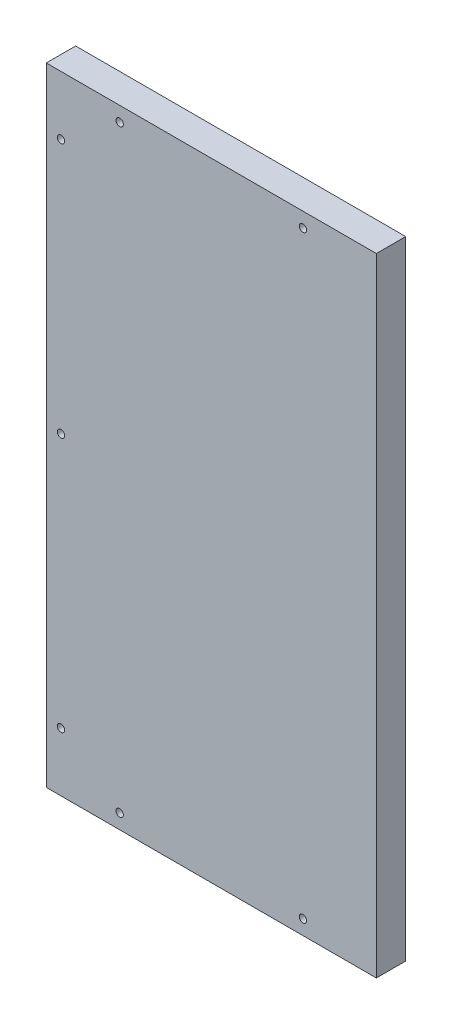
ISO-10303-21;
HEADER;
FILE_DESCRIPTION(('STEP AP214'),'2;1');
FILE_NAME('part.step','',(''),(''),'','','');
FILE_SCHEMA(('AUTOMOTIVE_DESIGN { 1 0 10303 214 1 1 1 1 }'));
ENDSEC;
DATA;
#1=APPLICATION_CONTEXT('core data for automotive mechanical design processes');
#2=APPLICATION_PROTOCOL_DEFINITION('international standard','automotive_design',2000,#1);
#3=PRODUCT_CONTEXT('',#1,'mechanical');
#4=PRODUCT('Part','Part','',(#3));
#5=PRODUCT_RELATED_PRODUCT_CATEGORY('part','',(#4));
#6=PRODUCT_DEFINITION_FORMATION('','',#4);
#7=PRODUCT_DEFINITION_CONTEXT('part definition',#1,'design');
#8=PRODUCT_DEFINITION('design','',#6,#7);
#9=PRODUCT_DEFINITION_SHAPE('','',#8);
#10=(LENGTH_UNIT() NAMED_UNIT(*) SI_UNIT(.MILLI.,.METRE.));
#11=(NAMED_UNIT(*) PLANE_ANGLE_UNIT() SI_UNIT($,.RADIAN.));
#12=(NAMED_UNIT(*) SI_UNIT($,.STERADIAN.) SOLID_ANGLE_UNIT());
#13=UNCERTAINTY_MEASURE_WITH_UNIT(LENGTH_MEASURE(1.E-05),#10,'distance_accuracy_value','');
#14=(GEOMETRIC_REPRESENTATION_CONTEXT(3) GLOBAL_UNCERTAINTY_ASSIGNED_CONTEXT((#13)) GLOBAL_UNIT_ASSIGNED_CONTEXT((#10,
#11,#12)) REPRESENTATION_CONTEXT('',''));
#15=CARTESIAN_POINT('',(0.,0.,0.));
#16=DIRECTION('',(0.,0.,1.));
#17=DIRECTION('',(1.,0.,0.));
#18=AXIS2_PLACEMENT_3D('',#15,#16,#17);
#19=CARTESIAN_POINT('',(-234.75296718065,82.8417413816963,12.6999999999999));
#20=DIRECTION('',(1.,0.,0.));
#21=DIRECTION('',(0.,1.,0.));
#22=AXIS2_PLACEMENT_3D('',#19,#20,#21);
#23=PLANE('',#22);
#24=DIRECTION('',(0.,-1.,0.));
#25=VECTOR('',#24,1.);
#26=CARTESIAN_POINT('',(-234.75296718065,82.8417413816962,0.));
#27=LINE('',#26,#25);
#28=CARTESIAN_POINT('',(-234.75296718065,82.8417413816962,0.));
#29=VERTEX_POINT('',#28);
#30=CARTESIAN_POINT('',(-234.75296718065,-188.523788764369,6.66133814775094E-13));
#31=VERTEX_POINT('',#30);
#32=EDGE_CURVE('E107',#29,#31,#27,.T.);
#33=ORIENTED_EDGE('',*,*,#32,.T.);
#34=DIRECTION('',(0.,0.,-1.));
#35=VECTOR('',#34,1.);
#36=CARTESIAN_POINT('',(-234.75296718065,-188.523788764369,12.7000000000006));
#37=LINE('',#36,#35);
#38=CARTESIAN_POINT('',(-234.75296718065,-188.523788764369,12.7000000000006));
#39=VERTEX_POINT('',#38);
#40=EDGE_CURVE('E11',#39,#31,#37,.T.);
#41=ORIENTED_EDGE('',*,*,#40,.F.);
#42=DIRECTION('',(0.,-1.,0.));
#43=VECTOR('',#42,1.);
#44=CARTESIAN_POINT('',(-234.75296718065,82.8417413816963,12.6999999999999));
#45=LINE('',#44,#43);
#46=CARTESIAN_POINT('',(-234.75296718065,82.8417413816963,12.6999999999999));
#47=VERTEX_POINT('',#46);
#48=EDGE_CURVE('E94',#47,#39,#45,.T.);
#49=ORIENTED_EDGE('',*,*,#48,.F.);
#50=DIRECTION('',(0.,0.,-1.));
#51=VECTOR('',#50,1.);
#52=CARTESIAN_POINT('',(-234.75296718065,82.8417413816963,12.6999999999999));
#53=LINE('',#52,#51);
#54=EDGE_CURVE('E103',#47,#29,#53,.T.);
#55=ORIENTED_EDGE('',*,*,#54,.T.);
#56=EDGE_LOOP('',(#33,#41,#49,#55));
#57=FACE_BOUND('',#56,.T.);
#58=ADVANCED_FACE('F41',(#57),#23,.F.);
#59=CARTESIAN_POINT('',(-234.75296718065,-188.523788764369,12.7000000000006));
#60=DIRECTION('',(0.,1.,0.));
#61=DIRECTION('',(0.,0.,1.));
#62=AXIS2_PLACEMENT_3D('',#59,#60,#61);
#63=PLANE('',#62);
#64=DIRECTION('',(1.,0.,0.));
#65=VECTOR('',#64,1.);
#66=CARTESIAN_POINT('',(-234.75296718065,-188.523788764369,6.66133814775094E-13));
#67=LINE('',#66,#65);
#68=CARTESIAN_POINT('',(-91.9973273926184,-188.523788764369,1.33226762955019E-12));
#69=VERTEX_POINT('',#68);
#70=EDGE_CURVE('E98',#31,#69,#67,.T.);
#71=ORIENTED_EDGE('',*,*,#70,.T.);
#72=DIRECTION('',(0.,0.,-1.));
#73=VECTOR('',#72,1.);
#74=CARTESIAN_POINT('',(-91.9973273926177,-188.523788764369,12.7000000000013));
#75=LINE('',#74,#73);
#76=CARTESIAN_POINT('',(-91.9973273926177,-188.523788764369,12.7000000000013));
#77=VERTEX_POINT('',#76);
#78=EDGE_CURVE('E50',#77,#69,#75,.T.);
#79=ORIENTED_EDGE('',*,*,#78,.F.);
#80=DIRECTION('',(1.,0.,0.));
#81=VECTOR('',#80,1.);
#82=CARTESIAN_POINT('',(-234.75296718065,-188.523788764369,12.7000000000006));
#83=LINE('',#82,#81);
#84=EDGE_CURVE('E89',#39,#77,#83,.T.);
#85=ORIENTED_EDGE('',*,*,#84,.F.);
#86=ORIENTED_EDGE('',*,*,#40,.T.);
#87=EDGE_LOOP('',(#71,#79,#85,#86));
#88=FACE_BOUND('',#87,.T.);
#89=ADVANCED_FACE('F97',(#88),#63,.F.);
#90=CARTESIAN_POINT('',(-91.9973273926187,82.8417413816967,12.6999999999999));
#91=DIRECTION('',(-1.,0.,0.));
#92=DIRECTION('',(0.,-1.,0.));
#93=AXIS2_PLACEMENT_3D('',#90,#91,#92);
#94=PLANE('',#93);
#95=DIRECTION('',(0.,1.,0.));
#96=VECTOR('',#95,1.);
#97=CARTESIAN_POINT('',(-91.9973273926186,82.8417413816962,0.));
#98=LINE('',#97,#96);
#99=CARTESIAN_POINT('',(-91.9973273926186,82.8417413816962,0.));
#100=VERTEX_POINT('',#99);
#101=EDGE_CURVE('E76',#69,#100,#98,.T.);
#102=ORIENTED_EDGE('',*,*,#101,.T.);
#103=DIRECTION('',(0.,0.,-1.));
#104=VECTOR('',#103,1.);
#105=CARTESIAN_POINT('',(-91.9973273926187,82.8417413816967,12.6999999999999));
#106=LINE('',#105,#104);
#107=CARTESIAN_POINT('',(-91.9973273926187,82.8417413816967,12.6999999999999));
#108=VERTEX_POINT('',#107);
#109=EDGE_CURVE('E99',#108,#100,#106,.T.);
#110=ORIENTED_EDGE('',*,*,#109,.F.);
#111=DIRECTION('',(0.,1.,0.));
#112=VECTOR('',#111,1.);
#113=CARTESIAN_POINT('',(-91.9973273926187,82.8417413816967,12.6999999999999));
#114=LINE('',#113,#112);
#115=EDGE_CURVE('E92',#77,#108,#114,.T.);
#116=ORIENTED_EDGE('',*,*,#115,.F.);
#117=ORIENTED_EDGE('',*,*,#78,.T.);
#118=EDGE_LOOP('',(#102,#110,#116,#117));
#119=FACE_BOUND('',#118,.T.);
#120=ADVANCED_FACE('F101',(#119),#94,.F.);
#121=CARTESIAN_POINT('',(-234.75296718065,82.8417413816963,12.6999999999999));
#122=DIRECTION('',(0.,-1.,0.));
#123=DIRECTION('',(0.,0.,-1.));
#124=AXIS2_PLACEMENT_3D('',#121,#122,#123);
#125=PLANE('',#124);
#126=DIRECTION('',(-1.,0.,0.));
#127=VECTOR('',#126,1.);
#128=CARTESIAN_POINT('',(-234.75296718065,82.8417413816962,0.));
#129=LINE('',#128,#127);
#130=EDGE_CURVE('E82',#100,#29,#129,.T.);
#131=ORIENTED_EDGE('',*,*,#130,.T.);
#132=ORIENTED_EDGE('',*,*,#54,.F.);
#133=DIRECTION('',(-1.,0.,0.));
#134=VECTOR('',#133,1.);
#135=CARTESIAN_POINT('',(-234.75296718065,82.8417413816963,12.6999999999999));
#136=LINE('',#135,#134);
#137=EDGE_CURVE('E59',#108,#47,#136,.T.);
#138=ORIENTED_EDGE('',*,*,#137,.F.);
#139=ORIENTED_EDGE('',*,*,#109,.T.);
#140=EDGE_LOOP('',(#131,#132,#138,#139));
#141=FACE_BOUND('',#140,.T.);
#142=ADVANCED_FACE('F190',(#141),#125,.F.);
#143=CARTESIAN_POINT('',(5.55111512312578E-13,-1.45716771982052E-13,12.7000000000015));
#144=DIRECTION('',(0.,0.,1.));
#145=DIRECTION('',(1.,0.,0.));
#146=AXIS2_PLACEMENT_3D('',#143,#144,#145);
#147=PLANE('',#146);
#148=CARTESIAN_POINT('',(-203.002967180651,76.4917413816922,12.6999999999999));
#149=DIRECTION('',(0.,0.,1.));
#150=DIRECTION('',(1.,0.,0.));
#151=AXIS2_PLACEMENT_3D('',#148,#149,#150);
#152=CIRCLE('',#151,1.58749999999999);
#153=CARTESIAN_POINT('',(-201.415467180651,76.4917413816922,12.6999999999999));
#154=VERTEX_POINT('',#153);
#155=EDGE_CURVE('E44',#154,#154,#152,.T.);
#156=ORIENTED_EDGE('',*,*,#155,.F.);
#157=EDGE_LOOP('',(#156));
#158=FACE_BOUND('',#157,.T.);
#159=CARTESIAN_POINT('',(-123.74732739262,76.4917413816922,12.6999999999999));
#160=DIRECTION('',(0.,0.,1.));
#161=DIRECTION('',(1.,0.,0.));
#162=AXIS2_PLACEMENT_3D('',#159,#160,#161);
#163=CIRCLE('',#162,1.5875);
#164=CARTESIAN_POINT('',(-122.15982739262,76.4917413816922,12.6999999999999));
#165=VERTEX_POINT('',#164);
#166=EDGE_CURVE('E138',#165,#165,#163,.T.);
#167=ORIENTED_EDGE('',*,*,#166,.F.);
#168=EDGE_LOOP('',(#167));
#169=FACE_BOUND('',#168,.T.);
#170=CARTESIAN_POINT('',(-228.402967180651,57.4417413816921,12.6999999999999));
#171=DIRECTION('',(0.,0.,1.));
#172=DIRECTION('',(1.,0.,0.));
#173=AXIS2_PLACEMENT_3D('',#170,#171,#172);
#174=CIRCLE('',#173,1.58749999999999);
#175=CARTESIAN_POINT('',(-226.815467180651,57.4417413816921,12.6999999999999));
#176=VERTEX_POINT('',#175);
#177=EDGE_CURVE('E134',#176,#176,#174,.T.);
#178=ORIENTED_EDGE('',*,*,#177,.F.);
#179=EDGE_LOOP('',(#178));
#180=FACE_BOUND('',#179,.T.);
#181=CARTESIAN_POINT('',(-228.402967180651,-52.8410236913404,12.7000000000004));
#182=DIRECTION('',(0.,0.,1.));
#183=DIRECTION('',(1.,0.,0.));
#184=AXIS2_PLACEMENT_3D('',#181,#182,#183);
#185=CIRCLE('',#184,1.58749999999999);
#186=CARTESIAN_POINT('',(-226.815467180651,-52.8410236913404,12.7000000000004));
#187=VERTEX_POINT('',#186);
#188=EDGE_CURVE('E129',#187,#187,#185,.T.);
#189=ORIENTED_EDGE('',*,*,#188,.F.);
#190=EDGE_LOOP('',(#189));
#191=FACE_BOUND('',#190,.T.);
#192=CARTESIAN_POINT('',(-228.402967180651,-163.123788764373,12.7000000000008));
#193=DIRECTION('',(0.,0.,1.));
#194=DIRECTION('',(1.,0.,0.));
#195=AXIS2_PLACEMENT_3D('',#192,#193,#194);
#196=CIRCLE('',#195,1.58749999999999);
#197=CARTESIAN_POINT('',(-226.815467180651,-163.123788764373,12.7000000000008));
#198=VERTEX_POINT('',#197);
#199=EDGE_CURVE('E124',#198,#198,#196,.T.);
#200=ORIENTED_EDGE('',*,*,#199,.F.);
#201=EDGE_LOOP('',(#200));
#202=FACE_BOUND('',#201,.T.);
#203=CARTESIAN_POINT('',(-123.747327392619,-182.173788764373,12.7000000000017));
#204=DIRECTION('',(0.,0.,1.));
#205=DIRECTION('',(1.,0.,0.));
#206=AXIS2_PLACEMENT_3D('',#203,#204,#205);
#207=CIRCLE('',#206,1.5875);
#208=CARTESIAN_POINT('',(-122.159827392619,-182.173788764373,12.7000000000017));
#209=VERTEX_POINT('',#208);
#210=EDGE_CURVE('E119',#209,#209,#207,.T.);
#211=ORIENTED_EDGE('',*,*,#210,.F.);
#212=EDGE_LOOP('',(#211));
#213=FACE_BOUND('',#212,.T.);
#214=CARTESIAN_POINT('',(-203.002967180651,-182.173788764373,12.7000000000013));
#215=DIRECTION('',(0.,0.,1.));
#216=DIRECTION('',(1.,0.,0.));
#217=AXIS2_PLACEMENT_3D('',#214,#215,#216);
#218=CIRCLE('',#217,1.58749999999999);
#219=CARTESIAN_POINT('',(-201.415467180651,-182.173788764373,12.7000000000013));
#220=VERTEX_POINT('',#219);
#221=EDGE_CURVE('E110',#220,#220,#218,.T.);
#222=ORIENTED_EDGE('',*,*,#221,.F.);
#223=EDGE_LOOP('',(#222));
#224=FACE_BOUND('',#223,.T.);
#225=ORIENTED_EDGE('',*,*,#48,.T.);
#226=ORIENTED_EDGE('',*,*,#84,.T.);
#227=ORIENTED_EDGE('',*,*,#115,.T.);
#228=ORIENTED_EDGE('',*,*,#137,.T.);
#229=EDGE_LOOP('',(#225,#226,#227,#228));
#230=FACE_BOUND('',#229,.T.);
#231=ADVANCED_FACE('F90',(#158,#169,#180,#191,#202,#213,#224,#230),#147,.T.);
#232=CARTESIAN_POINT('',(0.,0.,0.));
#233=DIRECTION('',(0.,0.,1.));
#234=DIRECTION('',(1.,0.,0.));
#235=AXIS2_PLACEMENT_3D('',#232,#233,#234);
#236=PLANE('',#235);
#237=CARTESIAN_POINT('',(-203.002967180651,76.4917413816922,-4.44089209850063E-13));
#238=DIRECTION('',(0.,0.,-1.));
#239=DIRECTION('',(-1.,0.,0.));
#240=AXIS2_PLACEMENT_3D('',#237,#238,#239);
#241=CIRCLE('',#240,5.08);
#242=CARTESIAN_POINT('',(-208.082967180651,76.4917413816922,-4.55087079131999E-13));
#243=VERTEX_POINT('',#242);
#244=EDGE_CURVE('E333',#243,#243,#241,.T.);
#245=ORIENTED_EDGE('',*,*,#244,.F.);
#246=EDGE_LOOP('',(#245));
#247=FACE_BOUND('',#246,.T.);
#248=CARTESIAN_POINT('',(-123.74732739262,76.4917413816921,-4.44089209850063E-13));
#249=DIRECTION('',(0.,0.,-1.));
#250=DIRECTION('',(-1.,0.,0.));
#251=AXIS2_PLACEMENT_3D('',#248,#249,#250);
#252=CIRCLE('',#251,5.08);
#253=CARTESIAN_POINT('',(-128.82732739262,76.4917413816921,-4.55087079131999E-13));
#254=VERTEX_POINT('',#253);
#255=EDGE_CURVE('E147',#254,#254,#252,.T.);
#256=ORIENTED_EDGE('',*,*,#255,.F.);
#257=EDGE_LOOP('',(#256));
#258=FACE_BOUND('',#257,.T.);
#259=CARTESIAN_POINT('',(-228.402967180651,57.4417413816921,-4.44089209850063E-13));
#260=DIRECTION('',(0.,0.,-1.));
#261=DIRECTION('',(-1.,0.,0.));
#262=AXIS2_PLACEMENT_3D('',#259,#260,#261);
#263=CIRCLE('',#262,5.08);
#264=CARTESIAN_POINT('',(-233.482967180651,57.4417413816921,-4.55087079131999E-13));
#265=VERTEX_POINT('',#264);
#266=EDGE_CURVE('E140',#265,#265,#263,.T.);
#267=ORIENTED_EDGE('',*,*,#266,.F.);
#268=EDGE_LOOP('',(#267));
#269=FACE_BOUND('',#268,.T.);
#270=CARTESIAN_POINT('',(-228.402967180651,-52.8410236913403,-4.44089209850063E-13));
#271=DIRECTION('',(0.,0.,-1.));
#272=DIRECTION('',(-1.,0.,0.));
#273=AXIS2_PLACEMENT_3D('',#270,#271,#272);
#274=CIRCLE('',#273,5.08);
#275=CARTESIAN_POINT('',(-233.482967180651,-52.8410236913403,-4.55087079131999E-13));
#276=VERTEX_POINT('',#275);
#277=EDGE_CURVE('E136',#276,#276,#274,.T.);
#278=ORIENTED_EDGE('',*,*,#277,.F.);
#279=EDGE_LOOP('',(#278));
#280=FACE_BOUND('',#279,.T.);
#281=CARTESIAN_POINT('',(-228.402967180651,-163.123788764373,-2.22044604925031E-13));
#282=DIRECTION('',(0.,0.,-1.));
#283=DIRECTION('',(-1.,0.,0.));
#284=AXIS2_PLACEMENT_3D('',#281,#282,#283);
#285=CIRCLE('',#284,5.08);
#286=CARTESIAN_POINT('',(-233.482967180651,-163.123788764373,-2.33042474206968E-13));
#287=VERTEX_POINT('',#286);
#288=EDGE_CURVE('E132',#287,#287,#285,.T.);
#289=ORIENTED_EDGE('',*,*,#288,.F.);
#290=EDGE_LOOP('',(#289));
#291=FACE_BOUND('',#290,.T.);
#292=CARTESIAN_POINT('',(-123.74732739262,-182.173788764373,4.44089209850063E-13));
#293=DIRECTION('',(0.,0.,-1.));
#294=DIRECTION('',(-1.,0.,0.));
#295=AXIS2_PLACEMENT_3D('',#292,#293,#294);
#296=CIRCLE('',#295,5.08);
#297=CARTESIAN_POINT('',(-128.82732739262,-182.173788764373,4.33091340568126E-13));
#298=VERTEX_POINT('',#297);
#299=EDGE_CURVE('E127',#298,#298,#296,.T.);
#300=ORIENTED_EDGE('',*,*,#299,.F.);
#301=EDGE_LOOP('',(#300));
#302=FACE_BOUND('',#301,.T.);
#303=CARTESIAN_POINT('',(-203.002967180651,-182.173788764373,-2.22044604925031E-13));
#304=DIRECTION('',(0.,0.,-1.));
#305=DIRECTION('',(-1.,0.,0.));
#306=AXIS2_PLACEMENT_3D('',#303,#304,#305);
#307=CIRCLE('',#306,5.08);
#308=CARTESIAN_POINT('',(-208.082967180651,-182.173788764373,-2.33042474206968E-13));
#309=VERTEX_POINT('',#308);
#310=EDGE_CURVE('E122',#309,#309,#307,.T.);
#311=ORIENTED_EDGE('',*,*,#310,.F.);
#312=EDGE_LOOP('',(#311));
#313=FACE_BOUND('',#312,.T.);
#314=ORIENTED_EDGE('',*,*,#32,.F.);
#315=ORIENTED_EDGE('',*,*,#130,.F.);
#316=ORIENTED_EDGE('',*,*,#101,.F.);
#317=ORIENTED_EDGE('',*,*,#70,.F.);
#318=EDGE_LOOP('',(#314,#315,#316,#317));
#319=FACE_BOUND('',#318,.T.);
#320=ADVANCED_FACE('F183',(#247,#258,#269,#280,#291,#302,#313,#319),#236,.F.);
#321=CARTESIAN_POINT('',(-203.002967180651,-182.173788764373,-2.22044604925031E-13));
#322=DIRECTION('',(0.,0.,-1.));
#323=DIRECTION('',(-1.,0.,0.));
#324=AXIS2_PLACEMENT_3D('',#321,#322,#323);
#325=CYLINDRICAL_SURFACE('',#324,1.58749999999999);
#326=ORIENTED_EDGE('',*,*,#221,.T.);
#327=EDGE_LOOP('',(#326));
#328=FACE_BOUND('',#327,.T.);
#329=CARTESIAN_POINT('',(-203.002967180651,-182.173788764374,4.01766166222028));
#330=DIRECTION('',(0.,0.,-1.));
#331=DIRECTION('',(-1.,0.,0.));
#332=AXIS2_PLACEMENT_3D('',#329,#330,#331);
#333=CIRCLE('',#332,1.58749999999999);
#334=CARTESIAN_POINT('',(-204.590467180651,-182.173788764374,4.01766166222028));
#335=VERTEX_POINT('',#334);
#336=EDGE_CURVE('E118',#335,#335,#333,.T.);
#337=ORIENTED_EDGE('',*,*,#336,.T.);
#338=EDGE_LOOP('',(#337));
#339=FACE_BOUND('',#338,.T.);
#340=ADVANCED_FACE('F174',(#328,#339),#325,.F.);
#341=CARTESIAN_POINT('',(-203.002967180651,-182.173788764373,-2.22044604925031E-13));
#342=DIRECTION('',(0.,0.,-1.));
#343=DIRECTION('',(-1.,0.,0.));
#344=AXIS2_PLACEMENT_3D('',#341,#342,#343);
#345=CONICAL_SURFACE('',#344,5.08,0.715584993317676);
#346=ORIENTED_EDGE('',*,*,#336,.F.);
#347=EDGE_LOOP('',(#346));
#348=FACE_BOUND('',#347,.T.);
#349=ORIENTED_EDGE('',*,*,#310,.T.);
#350=EDGE_LOOP('',(#349));
#351=FACE_BOUND('',#350,.T.);
#352=ADVANCED_FACE('F176',(#348,#351),#345,.F.);
#353=CARTESIAN_POINT('',(-123.74732739262,-182.173788764373,4.44089209850063E-13));
#354=DIRECTION('',(0.,0.,-1.));
#355=DIRECTION('',(-1.,0.,0.));
#356=AXIS2_PLACEMENT_3D('',#353,#354,#355);
#357=CYLINDRICAL_SURFACE('',#356,1.5875);
#358=ORIENTED_EDGE('',*,*,#210,.T.);
#359=EDGE_LOOP('',(#358));
#360=FACE_BOUND('',#359,.T.);
#361=CARTESIAN_POINT('',(-123.74732739262,-182.173788764373,4.0176616622194));
#362=DIRECTION('',(0.,0.,-1.));
#363=DIRECTION('',(-1.,0.,0.));
#364=AXIS2_PLACEMENT_3D('',#361,#362,#363);
#365=CIRCLE('',#364,1.58749999999999);
#366=CARTESIAN_POINT('',(-125.33482739262,-182.173788764373,4.01766166221939));
#367=VERTEX_POINT('',#366);
#368=EDGE_CURVE('E123',#367,#367,#365,.T.);
#369=ORIENTED_EDGE('',*,*,#368,.T.);
#370=EDGE_LOOP('',(#369));
#371=FACE_BOUND('',#370,.T.);
#372=ADVANCED_FACE('F179',(#360,#371),#357,.F.);
#373=CARTESIAN_POINT('',(-123.74732739262,-182.173788764373,4.44089209850063E-13));
#374=DIRECTION('',(0.,0.,-1.));
#375=DIRECTION('',(-1.,0.,0.));
#376=AXIS2_PLACEMENT_3D('',#373,#374,#375);
#377=CONICAL_SURFACE('',#376,5.08,0.715584993317676);
#378=ORIENTED_EDGE('',*,*,#368,.F.);
#379=EDGE_LOOP('',(#378));
#380=FACE_BOUND('',#379,.T.);
#381=ORIENTED_EDGE('',*,*,#299,.T.);
#382=EDGE_LOOP('',(#381));
#383=FACE_BOUND('',#382,.T.);
#384=ADVANCED_FACE('F238',(#380,#383),#377,.F.);
#385=CARTESIAN_POINT('',(-228.402967180651,-163.123788764373,-2.22044604925031E-13));
#386=DIRECTION('',(0.,0.,-1.));
#387=DIRECTION('',(-1.,0.,0.));
#388=AXIS2_PLACEMENT_3D('',#385,#386,#387);
#389=CYLINDRICAL_SURFACE('',#388,1.58749999999999);
#390=ORIENTED_EDGE('',*,*,#199,.T.);
#391=EDGE_LOOP('',(#390));
#392=FACE_BOUND('',#391,.T.);
#393=CARTESIAN_POINT('',(-228.402967180651,-163.123788764373,4.01766166221917));
#394=DIRECTION('',(0.,0.,-1.));
#395=DIRECTION('',(-1.,0.,0.));
#396=AXIS2_PLACEMENT_3D('',#393,#394,#395);
#397=CIRCLE('',#396,1.58749999999999);
#398=CARTESIAN_POINT('',(-229.990467180651,-163.123788764373,4.01766166221917));
#399=VERTEX_POINT('',#398);
#400=EDGE_CURVE('E128',#399,#399,#397,.T.);
#401=ORIENTED_EDGE('',*,*,#400,.T.);
#402=EDGE_LOOP('',(#401));
#403=FACE_BOUND('',#402,.T.);
#404=ADVANCED_FACE('F246',(#392,#403),#389,.F.);
#405=CARTESIAN_POINT('',(-228.402967180651,-163.123788764373,-2.22044604925031E-13));
#406=DIRECTION('',(0.,0.,-1.));
#407=DIRECTION('',(-1.,0.,0.));
#408=AXIS2_PLACEMENT_3D('',#405,#406,#407);
#409=CONICAL_SURFACE('',#408,5.08,0.715584993317676);
#410=ORIENTED_EDGE('',*,*,#400,.F.);
#411=EDGE_LOOP('',(#410));
#412=FACE_BOUND('',#411,.T.);
#413=ORIENTED_EDGE('',*,*,#288,.T.);
#414=EDGE_LOOP('',(#413));
#415=FACE_BOUND('',#414,.T.);
#416=ADVANCED_FACE('F254',(#412,#415),#409,.F.);
#417=CARTESIAN_POINT('',(-228.402967180651,-52.8410236913403,-4.44089209850063E-13));
#418=DIRECTION('',(0.,0.,-1.));
#419=DIRECTION('',(-1.,0.,0.));
#420=AXIS2_PLACEMENT_3D('',#417,#418,#419);
#421=CYLINDRICAL_SURFACE('',#420,1.58749999999999);
#422=ORIENTED_EDGE('',*,*,#188,.T.);
#423=EDGE_LOOP('',(#422));
#424=FACE_BOUND('',#423,.T.);
#425=CARTESIAN_POINT('',(-228.402967180651,-52.8410236913404,4.01766166221917));
#426=DIRECTION('',(0.,0.,-1.));
#427=DIRECTION('',(-1.,0.,0.));
#428=AXIS2_PLACEMENT_3D('',#425,#426,#427);
#429=CIRCLE('',#428,1.58749999999999);
#430=CARTESIAN_POINT('',(-229.990467180651,-52.8410236913404,4.01766166221917));
#431=VERTEX_POINT('',#430);
#432=EDGE_CURVE('E133',#431,#431,#429,.T.);
#433=ORIENTED_EDGE('',*,*,#432,.T.);
#434=EDGE_LOOP('',(#433));
#435=FACE_BOUND('',#434,.T.);
#436=ADVANCED_FACE('F262',(#424,#435),#421,.F.);
#437=CARTESIAN_POINT('',(-228.402967180651,-52.8410236913403,-4.44089209850063E-13));
#438=DIRECTION('',(0.,0.,-1.));
#439=DIRECTION('',(-1.,0.,0.));
#440=AXIS2_PLACEMENT_3D('',#437,#438,#439);
#441=CONICAL_SURFACE('',#440,5.08,0.715584993317676);
#442=ORIENTED_EDGE('',*,*,#432,.F.);
#443=EDGE_LOOP('',(#442));
#444=FACE_BOUND('',#443,.T.);
#445=ORIENTED_EDGE('',*,*,#277,.T.);
#446=EDGE_LOOP('',(#445));
#447=FACE_BOUND('',#446,.T.);
#448=ADVANCED_FACE('F270',(#444,#447),#441,.F.);
#449=CARTESIAN_POINT('',(-228.402967180651,57.4417413816921,-4.44089209850063E-13));
#450=DIRECTION('',(0.,0.,-1.));
#451=DIRECTION('',(-1.,0.,0.));
#452=AXIS2_PLACEMENT_3D('',#449,#450,#451);
#453=CYLINDRICAL_SURFACE('',#452,1.58749999999999);
#454=ORIENTED_EDGE('',*,*,#177,.T.);
#455=EDGE_LOOP('',(#454));
#456=FACE_BOUND('',#455,.T.);
#457=CARTESIAN_POINT('',(-228.402967180651,57.4417413816922,4.01766166221917));
#458=DIRECTION('',(0.,0.,-1.));
#459=DIRECTION('',(-1.,0.,0.));
#460=AXIS2_PLACEMENT_3D('',#457,#458,#459);
#461=CIRCLE('',#460,1.58749999999999);
#462=CARTESIAN_POINT('',(-229.990467180651,57.4417413816922,4.01766166221917));
#463=VERTEX_POINT('',#462);
#464=EDGE_CURVE('E137',#463,#463,#461,.T.);
#465=ORIENTED_EDGE('',*,*,#464,.T.);
#466=EDGE_LOOP('',(#465));
#467=FACE_BOUND('',#466,.T.);
#468=ADVANCED_FACE('F278',(#456,#467),#453,.F.);
#469=CARTESIAN_POINT('',(-228.402967180651,57.4417413816921,-4.44089209850063E-13));
#470=DIRECTION('',(0.,0.,-1.));
#471=DIRECTION('',(-1.,0.,0.));
#472=AXIS2_PLACEMENT_3D('',#469,#470,#471);
#473=CONICAL_SURFACE('',#472,5.08,0.715584993317676);
#474=ORIENTED_EDGE('',*,*,#464,.F.);
#475=EDGE_LOOP('',(#474));
#476=FACE_BOUND('',#475,.T.);
#477=ORIENTED_EDGE('',*,*,#266,.T.);
#478=EDGE_LOOP('',(#477));
#479=FACE_BOUND('',#478,.T.);
#480=ADVANCED_FACE('F286',(#476,#479),#473,.F.);
#481=CARTESIAN_POINT('',(-123.74732739262,76.4917413816921,-4.44089209850063E-13));
#482=DIRECTION('',(0.,0.,-1.));
#483=DIRECTION('',(-1.,0.,0.));
#484=AXIS2_PLACEMENT_3D('',#481,#482,#483);
#485=CYLINDRICAL_SURFACE('',#484,1.5875);
#486=ORIENTED_EDGE('',*,*,#166,.T.);
#487=EDGE_LOOP('',(#486));
#488=FACE_BOUND('',#487,.T.);
#489=CARTESIAN_POINT('',(-123.74732739262,76.4917413816927,4.01766166221895));
#490=DIRECTION('',(0.,0.,-1.));
#491=DIRECTION('',(-1.,0.,0.));
#492=AXIS2_PLACEMENT_3D('',#489,#490,#491);
#493=CIRCLE('',#492,1.58749999999999);
#494=CARTESIAN_POINT('',(-125.33482739262,76.4917413816927,4.01766166221895));
#495=VERTEX_POINT('',#494);
#496=EDGE_CURVE('E141',#495,#495,#493,.T.);
#497=ORIENTED_EDGE('',*,*,#496,.T.);
#498=EDGE_LOOP('',(#497));
#499=FACE_BOUND('',#498,.T.);
#500=ADVANCED_FACE('F294',(#488,#499),#485,.F.);
#501=CARTESIAN_POINT('',(-123.74732739262,76.4917413816921,-4.44089209850063E-13));
#502=DIRECTION('',(0.,0.,-1.));
#503=DIRECTION('',(-1.,0.,0.));
#504=AXIS2_PLACEMENT_3D('',#501,#502,#503);
#505=CONICAL_SURFACE('',#504,5.08,0.715584993317676);
#506=ORIENTED_EDGE('',*,*,#496,.F.);
#507=EDGE_LOOP('',(#506));
#508=FACE_BOUND('',#507,.T.);
#509=ORIENTED_EDGE('',*,*,#255,.T.);
#510=EDGE_LOOP('',(#509));
#511=FACE_BOUND('',#510,.T.);
#512=ADVANCED_FACE('F302',(#508,#511),#505,.F.);
#513=CARTESIAN_POINT('',(-203.002967180651,76.4917413816922,-4.44089209850063E-13));
#514=DIRECTION('',(0.,0.,-1.));
#515=DIRECTION('',(-1.,0.,0.));
#516=AXIS2_PLACEMENT_3D('',#513,#514,#515);
#517=CYLINDRICAL_SURFACE('',#516,1.58749999999999);
#518=ORIENTED_EDGE('',*,*,#155,.T.);
#519=EDGE_LOOP('',(#518));
#520=FACE_BOUND('',#519,.T.);
#521=CARTESIAN_POINT('',(-203.002967180651,76.4917413816922,4.01766166221895));
#522=DIRECTION('',(0.,0.,-1.));
#523=DIRECTION('',(-1.,0.,0.));
#524=AXIS2_PLACEMENT_3D('',#521,#522,#523);
#525=CIRCLE('',#524,1.58749999999999);
#526=CARTESIAN_POINT('',(-204.590467180651,76.4917413816922,4.01766166221895));
#527=VERTEX_POINT('',#526);
#528=EDGE_CURVE('E330',#527,#527,#525,.T.);
#529=ORIENTED_EDGE('',*,*,#528,.T.);
#530=EDGE_LOOP('',(#529));
#531=FACE_BOUND('',#530,.T.);
#532=ADVANCED_FACE('F309',(#520,#531),#517,.F.);
#533=CARTESIAN_POINT('',(-203.002967180651,76.4917413816922,-4.44089209850063E-13));
#534=DIRECTION('',(0.,0.,-1.));
#535=DIRECTION('',(-1.,0.,0.));
#536=AXIS2_PLACEMENT_3D('',#533,#534,#535);
#537=CONICAL_SURFACE('',#536,5.08,0.715584993317676);
#538=ORIENTED_EDGE('',*,*,#528,.F.);
#539=EDGE_LOOP('',(#538));
#540=FACE_BOUND('',#539,.T.);
#541=ORIENTED_EDGE('',*,*,#244,.T.);
#542=EDGE_LOOP('',(#541));
#543=FACE_BOUND('',#542,.T.);
#544=ADVANCED_FACE('F317',(#540,#543),#537,.F.);
#545=CLOSED_SHELL('',(#58,#89,#120,#142,#231,#320,#340,#352,#372,#384,#404,#416,#436,#448,#468,
#480,#500,#512,#532,#544));
#546=MANIFOLD_SOLID_BREP('B2',#545);
#547=ADVANCED_BREP_SHAPE_REPRESENTATION('',(#18,#546),#14);
#548=SHAPE_DEFINITION_REPRESENTATION(#9,#547);
ENDSEC;
END-ISO-10303-21;
